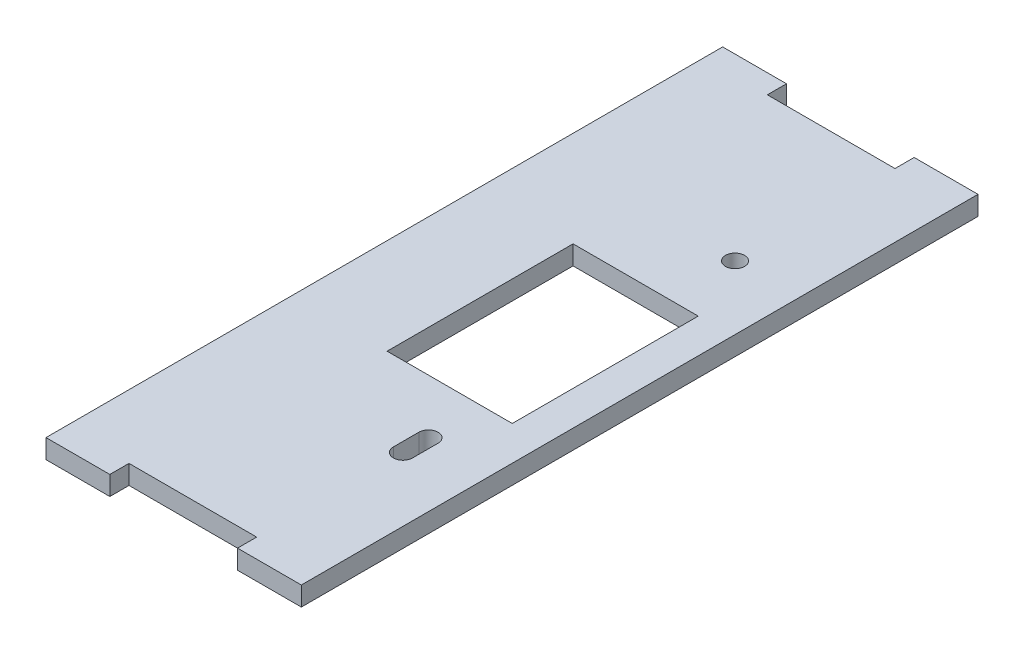
ISO-10303-21;
HEADER;
FILE_DESCRIPTION(('STEP AP214'),'2;1');
FILE_NAME('part.step','',(''),(''),'','','');
FILE_SCHEMA(('AUTOMOTIVE_DESIGN { 1 0 10303 214 1 1 1 1 }'));
ENDSEC;
DATA;
#1=APPLICATION_CONTEXT('core data for automotive mechanical design processes');
#2=APPLICATION_PROTOCOL_DEFINITION('international standard','automotive_design',2000,#1);
#3=PRODUCT_CONTEXT('',#1,'mechanical');
#4=PRODUCT('Part','Part','',(#3));
#5=PRODUCT_RELATED_PRODUCT_CATEGORY('part','',(#4));
#6=PRODUCT_DEFINITION_FORMATION('','',#4);
#7=PRODUCT_DEFINITION_CONTEXT('part definition',#1,'design');
#8=PRODUCT_DEFINITION('design','',#6,#7);
#9=PRODUCT_DEFINITION_SHAPE('','',#8);
#10=(LENGTH_UNIT() NAMED_UNIT(*) SI_UNIT(.MILLI.,.METRE.));
#11=(NAMED_UNIT(*) PLANE_ANGLE_UNIT() SI_UNIT($,.RADIAN.));
#12=(NAMED_UNIT(*) SI_UNIT($,.STERADIAN.) SOLID_ANGLE_UNIT());
#13=UNCERTAINTY_MEASURE_WITH_UNIT(LENGTH_MEASURE(1.E-05),#10,'distance_accuracy_value','');
#14=(GEOMETRIC_REPRESENTATION_CONTEXT(3) GLOBAL_UNCERTAINTY_ASSIGNED_CONTEXT((#13)) GLOBAL_UNIT_ASSIGNED_CONTEXT((#10,
#11,#12)) REPRESENTATION_CONTEXT('',''));
#15=CARTESIAN_POINT('',(0.,0.,0.));
#16=DIRECTION('',(0.,0.,1.));
#17=DIRECTION('',(1.,0.,0.));
#18=AXIS2_PLACEMENT_3D('',#15,#16,#17);
#19=CARTESIAN_POINT('',(0.,3.,-100.));
#20=DIRECTION('',(0.,0.,1.));
#21=DIRECTION('',(1.,0.,0.));
#22=AXIS2_PLACEMENT_3D('',#19,#20,#21);
#23=PLANE('',#22);
#24=DIRECTION('',(-1.,0.,0.));
#25=VECTOR('',#24,1.);
#26=CARTESIAN_POINT('',(0.,3.,-100.));
#27=LINE('',#26,#25);
#28=CARTESIAN_POINT('',(30.,3.,-100.));
#29=VERTEX_POINT('',#28);
#30=CARTESIAN_POINT('',(10.,3.,-100.));
#31=VERTEX_POINT('',#30);
#32=EDGE_CURVE('E12',#29,#31,#27,.T.);
#33=ORIENTED_EDGE('',*,*,#32,.F.);
#34=DIRECTION('',(0.,-1.,0.));
#35=VECTOR('',#34,1.);
#36=CARTESIAN_POINT('',(30.,3.,-100.));
#37=LINE('',#36,#35);
#38=CARTESIAN_POINT('',(30.,0.,-100.));
#39=VERTEX_POINT('',#38);
#40=EDGE_CURVE('E402',#29,#39,#37,.T.);
#41=ORIENTED_EDGE('',*,*,#40,.T.);
#42=DIRECTION('',(-1.,0.,0.));
#43=VECTOR('',#42,1.);
#44=CARTESIAN_POINT('',(0.,0.,-100.));
#45=LINE('',#44,#43);
#46=CARTESIAN_POINT('',(10.,0.,-100.));
#47=VERTEX_POINT('',#46);
#48=EDGE_CURVE('E50',#39,#47,#45,.T.);
#49=ORIENTED_EDGE('',*,*,#48,.T.);
#50=DIRECTION('',(0.,-1.,0.));
#51=VECTOR('',#50,1.);
#52=CARTESIAN_POINT('',(10.,3.,-100.));
#53=LINE('',#52,#51);
#54=EDGE_CURVE('E337',#31,#47,#53,.T.);
#55=ORIENTED_EDGE('',*,*,#54,.F.);
#56=EDGE_LOOP('',(#33,#41,#49,#55));
#57=FACE_BOUND('',#56,.T.);
#58=ADVANCED_FACE('F46',(#57),#23,.F.);
#59=CARTESIAN_POINT('',(0.,3.,0.));
#60=DIRECTION('',(0.,0.,-1.));
#61=DIRECTION('',(-1.,0.,0.));
#62=AXIS2_PLACEMENT_3D('',#59,#60,#61);
#63=PLANE('',#62);
#64=DIRECTION('',(1.,0.,0.));
#65=VECTOR('',#64,1.);
#66=CARTESIAN_POINT('',(0.,0.,0.));
#67=LINE('',#66,#65);
#68=CARTESIAN_POINT('',(10.,0.,0.));
#69=VERTEX_POINT('',#68);
#70=CARTESIAN_POINT('',(30.,0.,0.));
#71=VERTEX_POINT('',#70);
#72=EDGE_CURVE('E302',#69,#71,#67,.T.);
#73=ORIENTED_EDGE('',*,*,#72,.T.);
#74=DIRECTION('',(0.,1.,0.));
#75=VECTOR('',#74,1.);
#76=CARTESIAN_POINT('',(30.,0.,0.));
#77=LINE('',#76,#75);
#78=CARTESIAN_POINT('',(30.,3.,0.));
#79=VERTEX_POINT('',#78);
#80=EDGE_CURVE('E335',#71,#79,#77,.T.);
#81=ORIENTED_EDGE('',*,*,#80,.T.);
#82=DIRECTION('',(1.,0.,0.));
#83=VECTOR('',#82,1.);
#84=CARTESIAN_POINT('',(0.,3.,0.));
#85=LINE('',#84,#83);
#86=CARTESIAN_POINT('',(10.,3.,0.));
#87=VERTEX_POINT('',#86);
#88=EDGE_CURVE('E56',#87,#79,#85,.T.);
#89=ORIENTED_EDGE('',*,*,#88,.F.);
#90=DIRECTION('',(0.,1.,0.));
#91=VECTOR('',#90,1.);
#92=CARTESIAN_POINT('',(10.,0.,0.));
#93=LINE('',#92,#91);
#94=EDGE_CURVE('E303',#69,#87,#93,.T.);
#95=ORIENTED_EDGE('',*,*,#94,.F.);
#96=EDGE_LOOP('',(#73,#81,#89,#95));
#97=FACE_BOUND('',#96,.T.);
#98=ADVANCED_FACE('F427',(#97),#63,.F.);
#99=CARTESIAN_POINT('',(0.,3.,0.));
#100=DIRECTION('',(1.,0.,0.));
#101=DIRECTION('',(0.,0.,-1.));
#102=AXIS2_PLACEMENT_3D('',#99,#100,#101);
#103=PLANE('',#102);
#104=DIRECTION('',(0.,0.,1.));
#105=VECTOR('',#104,1.);
#106=CARTESIAN_POINT('',(0.,0.,0.));
#107=LINE('',#106,#105);
#108=CARTESIAN_POINT('',(0.,0.,-103.));
#109=VERTEX_POINT('',#108);
#110=CARTESIAN_POINT('',(0.,0.,3.));
#111=VERTEX_POINT('',#110);
#112=EDGE_CURVE('E300',#109,#111,#107,.T.);
#113=ORIENTED_EDGE('',*,*,#112,.T.);
#114=DIRECTION('',(0.,1.,0.));
#115=VECTOR('',#114,1.);
#116=CARTESIAN_POINT('',(0.,0.,3.));
#117=LINE('',#116,#115);
#118=CARTESIAN_POINT('',(0.,3.,3.));
#119=VERTEX_POINT('',#118);
#120=EDGE_CURVE('E321',#111,#119,#117,.T.);
#121=ORIENTED_EDGE('',*,*,#120,.T.);
#122=DIRECTION('',(0.,0.,1.));
#123=VECTOR('',#122,1.);
#124=CARTESIAN_POINT('',(0.,3.,0.));
#125=LINE('',#124,#123);
#126=CARTESIAN_POINT('',(0.,3.,-103.));
#127=VERTEX_POINT('',#126);
#128=EDGE_CURVE('E309',#127,#119,#125,.T.);
#129=ORIENTED_EDGE('',*,*,#128,.F.);
#130=DIRECTION('',(0.,-1.,0.));
#131=VECTOR('',#130,1.);
#132=CARTESIAN_POINT('',(0.,3.,-103.));
#133=LINE('',#132,#131);
#134=EDGE_CURVE('E339',#127,#109,#133,.T.);
#135=ORIENTED_EDGE('',*,*,#134,.T.);
#136=EDGE_LOOP('',(#113,#121,#129,#135));
#137=FACE_BOUND('',#136,.T.);
#138=ADVANCED_FACE('F48',(#137),#103,.F.);
#139=CARTESIAN_POINT('',(0.,3.,0.));
#140=DIRECTION('',(0.,-1.,0.));
#141=DIRECTION('',(0.,0.,-1.));
#142=AXIS2_PLACEMENT_3D('',#139,#140,#141);
#143=PLANE('',#142);
#144=DIRECTION('',(-1.,0.,0.));
#145=VECTOR('',#144,1.);
#146=CARTESIAN_POINT('',(0.,3.,-35.4335241021067));
#147=LINE('',#146,#145);
#148=CARTESIAN_POINT('',(34.6087175548564,3.,-35.4335241021067));
#149=VERTEX_POINT('',#148);
#150=CARTESIAN_POINT('',(15.,3.,-35.4335241021067));
#151=VERTEX_POINT('',#150);
#152=EDGE_CURVE('E216',#149,#151,#147,.T.);
#153=ORIENTED_EDGE('',*,*,#152,.T.);
#154=DIRECTION('',(0.,0.,-1.));
#155=VECTOR('',#154,1.);
#156=CARTESIAN_POINT('',(15.,3.,0.));
#157=LINE('',#156,#155);
#158=CARTESIAN_POINT('',(15.,3.,-64.5664758978933));
#159=VERTEX_POINT('',#158);
#160=EDGE_CURVE('E219',#151,#159,#157,.T.);
#161=ORIENTED_EDGE('',*,*,#160,.T.);
#162=DIRECTION('',(1.,0.,0.));
#163=VECTOR('',#162,1.);
#164=CARTESIAN_POINT('',(0.,3.,-64.5664758978933));
#165=LINE('',#164,#163);
#166=CARTESIAN_POINT('',(34.6087175548564,3.,-64.5664758978933));
#167=VERTEX_POINT('',#166);
#168=EDGE_CURVE('E211',#159,#167,#165,.T.);
#169=ORIENTED_EDGE('',*,*,#168,.T.);
#170=DIRECTION('',(0.,0.,1.));
#171=VECTOR('',#170,1.);
#172=CARTESIAN_POINT('',(34.6087175548564,3.,0.));
#173=LINE('',#172,#171);
#174=EDGE_CURVE('E191',#167,#149,#173,.T.);
#175=ORIENTED_EDGE('',*,*,#174,.T.);
#176=EDGE_LOOP('',(#153,#161,#169,#175));
#177=FACE_BOUND('',#176,.T.);
#178=CARTESIAN_POINT('',(30.,3.,-74.9384101052982));
#179=DIRECTION('',(0.,-1.,0.));
#180=DIRECTION('',(0.,0.,-1.));
#181=AXIS2_PLACEMENT_3D('',#178,#179,#180);
#182=CIRCLE('',#181,1.5);
#183=CARTESIAN_POINT('',(30.,3.,-76.4384101052982));
#184=VERTEX_POINT('',#183);
#185=EDGE_CURVE('E254',#184,#184,#182,.T.);
#186=ORIENTED_EDGE('',*,*,#185,.T.);
#187=EDGE_LOOP('',(#186));
#188=FACE_BOUND('',#187,.T.);
#189=DIRECTION('',(0.,0.,1.));
#190=VECTOR('',#189,1.);
#191=CARTESIAN_POINT('',(31.4768203958892,3.,0.));
#192=LINE('',#191,#190);
#193=CARTESIAN_POINT('',(31.4768203958892,3.,-26.9384101052982));
#194=VERTEX_POINT('',#193);
#195=CARTESIAN_POINT('',(31.4768203958892,3.,-22.9384101052982));
#196=VERTEX_POINT('',#195);
#197=EDGE_CURVE('E248',#194,#196,#192,.T.);
#198=ORIENTED_EDGE('',*,*,#197,.T.);
#199=CARTESIAN_POINT('',(29.9768203958892,3.,-22.9384101052982));
#200=DIRECTION('',(0.,-1.,0.));
#201=DIRECTION('',(0.,0.,-1.));
#202=AXIS2_PLACEMENT_3D('',#199,#200,#201);
#203=CIRCLE('',#202,1.5);
#204=CARTESIAN_POINT('',(28.4768203958892,3.,-22.9384101052982));
#205=VERTEX_POINT('',#204);
#206=EDGE_CURVE('E251',#196,#205,#203,.T.);
#207=ORIENTED_EDGE('',*,*,#206,.T.);
#208=DIRECTION('',(0.,0.,-1.));
#209=VECTOR('',#208,1.);
#210=CARTESIAN_POINT('',(28.4768203958892,3.,0.));
#211=LINE('',#210,#209);
#212=CARTESIAN_POINT('',(28.4768203958892,3.,-26.9384101052982));
#213=VERTEX_POINT('',#212);
#214=EDGE_CURVE('E227',#205,#213,#211,.T.);
#215=ORIENTED_EDGE('',*,*,#214,.T.);
#216=CARTESIAN_POINT('',(29.9768203958892,3.,-26.9384101052982));
#217=DIRECTION('',(0.,-1.,0.));
#218=DIRECTION('',(0.,0.,-1.));
#219=AXIS2_PLACEMENT_3D('',#216,#217,#218);
#220=CIRCLE('',#219,1.5);
#221=EDGE_CURVE('E245',#213,#194,#220,.T.);
#222=ORIENTED_EDGE('',*,*,#221,.T.);
#223=EDGE_LOOP('',(#198,#207,#215,#222));
#224=FACE_BOUND('',#223,.T.);
#225=DIRECTION('',(1.,0.,0.));
#226=VECTOR('',#225,1.);
#227=CARTESIAN_POINT('',(30.,3.,3.));
#228=LINE('',#227,#226);
#229=CARTESIAN_POINT('',(30.,3.,3.));
#230=VERTEX_POINT('',#229);
#231=CARTESIAN_POINT('',(40.,3.,3.));
#232=VERTEX_POINT('',#231);
#233=EDGE_CURVE('E284',#230,#232,#228,.T.);
#234=ORIENTED_EDGE('',*,*,#233,.T.);
#235=DIRECTION('',(0.,0.,-1.));
#236=VECTOR('',#235,1.);
#237=CARTESIAN_POINT('',(40.,3.,3.));
#238=LINE('',#237,#236);
#239=CARTESIAN_POINT('',(40.,3.,-103.));
#240=VERTEX_POINT('',#239);
#241=EDGE_CURVE('E258',#232,#240,#238,.T.);
#242=ORIENTED_EDGE('',*,*,#241,.T.);
#243=DIRECTION('',(1.,0.,0.));
#244=VECTOR('',#243,1.);
#245=CARTESIAN_POINT('',(30.,3.,-103.));
#246=LINE('',#245,#244);
#247=CARTESIAN_POINT('',(30.,3.,-103.));
#248=VERTEX_POINT('',#247);
#249=EDGE_CURVE('E362',#248,#240,#246,.T.);
#250=ORIENTED_EDGE('',*,*,#249,.F.);
#251=DIRECTION('',(0.,0.,-1.));
#252=VECTOR('',#251,1.);
#253=CARTESIAN_POINT('',(30.,3.,-100.));
#254=LINE('',#253,#252);
#255=EDGE_CURVE('E365',#29,#248,#254,.T.);
#256=ORIENTED_EDGE('',*,*,#255,.F.);
#257=ORIENTED_EDGE('',*,*,#32,.T.);
#258=DIRECTION('',(0.,0.,1.));
#259=VECTOR('',#258,1.);
#260=CARTESIAN_POINT('',(10.,3.,-100.));
#261=LINE('',#260,#259);
#262=CARTESIAN_POINT('',(10.,3.,-103.));
#263=VERTEX_POINT('',#262);
#264=EDGE_CURVE('E343',#263,#31,#261,.T.);
#265=ORIENTED_EDGE('',*,*,#264,.F.);
#266=DIRECTION('',(1.,0.,0.));
#267=VECTOR('',#266,1.);
#268=CARTESIAN_POINT('',(0.,3.,-103.));
#269=LINE('',#268,#267);
#270=EDGE_CURVE('E349',#127,#263,#269,.T.);
#271=ORIENTED_EDGE('',*,*,#270,.F.);
#272=ORIENTED_EDGE('',*,*,#128,.T.);
#273=DIRECTION('',(1.,0.,0.));
#274=VECTOR('',#273,1.);
#275=CARTESIAN_POINT('',(0.,3.,3.));
#276=LINE('',#275,#274);
#277=CARTESIAN_POINT('',(10.,3.,3.));
#278=VERTEX_POINT('',#277);
#279=EDGE_CURVE('E328',#119,#278,#276,.T.);
#280=ORIENTED_EDGE('',*,*,#279,.T.);
#281=DIRECTION('',(0.,0.,-1.));
#282=VECTOR('',#281,1.);
#283=CARTESIAN_POINT('',(10.,3.,0.));
#284=LINE('',#283,#282);
#285=EDGE_CURVE('E290',#278,#87,#284,.T.);
#286=ORIENTED_EDGE('',*,*,#285,.T.);
#287=ORIENTED_EDGE('',*,*,#88,.T.);
#288=DIRECTION('',(0.,0.,1.));
#289=VECTOR('',#288,1.);
#290=CARTESIAN_POINT('',(30.,3.,0.));
#291=LINE('',#290,#289);
#292=EDGE_CURVE('E279',#79,#230,#291,.T.);
#293=ORIENTED_EDGE('',*,*,#292,.T.);
#294=EDGE_LOOP('',(#234,#242,#250,#256,#257,#265,#271,#272,#280,#286,#287,#293));
#295=FACE_BOUND('',#294,.T.);
#296=ADVANCED_FACE('F375',(#177,#188,#224,#295),#143,.F.);
#297=CARTESIAN_POINT('',(0.,0.,0.));
#298=DIRECTION('',(0.,-1.,0.));
#299=DIRECTION('',(0.,0.,-1.));
#300=AXIS2_PLACEMENT_3D('',#297,#298,#299);
#301=PLANE('',#300);
#302=DIRECTION('',(0.,0.,-1.));
#303=VECTOR('',#302,1.);
#304=CARTESIAN_POINT('',(15.,0.,-64.5664758978933));
#305=LINE('',#304,#303);
#306=CARTESIAN_POINT('',(15.,0.,-35.4335241021067));
#307=VERTEX_POINT('',#306);
#308=CARTESIAN_POINT('',(15.,0.,-64.5664758978933));
#309=VERTEX_POINT('',#308);
#310=EDGE_CURVE('E72',#307,#309,#305,.T.);
#311=ORIENTED_EDGE('',*,*,#310,.F.);
#312=DIRECTION('',(-1.,0.,0.));
#313=VECTOR('',#312,1.);
#314=CARTESIAN_POINT('',(34.6087175548564,0.,-35.4335241021067));
#315=LINE('',#314,#313);
#316=CARTESIAN_POINT('',(34.6087175548564,0.,-35.4335241021067));
#317=VERTEX_POINT('',#316);
#318=EDGE_CURVE('E204',#317,#307,#315,.T.);
#319=ORIENTED_EDGE('',*,*,#318,.F.);
#320=DIRECTION('',(0.,0.,1.));
#321=VECTOR('',#320,1.);
#322=CARTESIAN_POINT('',(34.6087175548564,0.,-64.5664758978933));
#323=LINE('',#322,#321);
#324=CARTESIAN_POINT('',(34.6087175548564,0.,-64.5664758978933));
#325=VERTEX_POINT('',#324);
#326=EDGE_CURVE('E188',#325,#317,#323,.T.);
#327=ORIENTED_EDGE('',*,*,#326,.F.);
#328=DIRECTION('',(1.,0.,0.));
#329=VECTOR('',#328,1.);
#330=CARTESIAN_POINT('',(34.6087175548564,0.,-64.5664758978933));
#331=LINE('',#330,#329);
#332=EDGE_CURVE('E197',#309,#325,#331,.T.);
#333=ORIENTED_EDGE('',*,*,#332,.F.);
#334=EDGE_LOOP('',(#311,#319,#327,#333));
#335=FACE_BOUND('',#334,.T.);
#336=CARTESIAN_POINT('',(30.,0.,-74.9384101052982));
#337=DIRECTION('',(0.,-1.,0.));
#338=DIRECTION('',(0.,0.,-1.));
#339=AXIS2_PLACEMENT_3D('',#336,#337,#338);
#340=CIRCLE('',#339,1.5);
#341=CARTESIAN_POINT('',(30.,0.,-76.4384101052982));
#342=VERTEX_POINT('',#341);
#343=EDGE_CURVE('E223',#342,#342,#340,.T.);
#344=ORIENTED_EDGE('',*,*,#343,.F.);
#345=EDGE_LOOP('',(#344));
#346=FACE_BOUND('',#345,.T.);
#347=CARTESIAN_POINT('',(29.9768203958892,0.,-22.9384101052982));
#348=DIRECTION('',(0.,-1.,0.));
#349=DIRECTION('',(0.,0.,-1.));
#350=AXIS2_PLACEMENT_3D('',#347,#348,#349);
#351=CIRCLE('',#350,1.5);
#352=CARTESIAN_POINT('',(31.4768203958892,0.,-22.9384101052982));
#353=VERTEX_POINT('',#352);
#354=CARTESIAN_POINT('',(28.4768203958892,0.,-22.9384101052982));
#355=VERTEX_POINT('',#354);
#356=EDGE_CURVE('E228',#353,#355,#351,.T.);
#357=ORIENTED_EDGE('',*,*,#356,.F.);
#358=DIRECTION('',(0.,0.,1.));
#359=VECTOR('',#358,1.);
#360=CARTESIAN_POINT('',(31.4768203958892,0.,-26.9384101052982));
#361=LINE('',#360,#359);
#362=CARTESIAN_POINT('',(31.4768203958892,0.,-26.9384101052982));
#363=VERTEX_POINT('',#362);
#364=EDGE_CURVE('E629',#363,#353,#361,.T.);
#365=ORIENTED_EDGE('',*,*,#364,.F.);
#366=CARTESIAN_POINT('',(29.9768203958892,0.,-26.9384101052982));
#367=DIRECTION('',(0.,-1.,0.));
#368=DIRECTION('',(0.,0.,-1.));
#369=AXIS2_PLACEMENT_3D('',#366,#367,#368);
#370=CIRCLE('',#369,1.5);
#371=CARTESIAN_POINT('',(28.4768203958892,0.,-26.9384101052982));
#372=VERTEX_POINT('',#371);
#373=EDGE_CURVE('E634',#372,#363,#370,.T.);
#374=ORIENTED_EDGE('',*,*,#373,.F.);
#375=DIRECTION('',(0.,0.,-1.));
#376=VECTOR('',#375,1.);
#377=CARTESIAN_POINT('',(28.4768203958892,0.,-26.9384101052982));
#378=LINE('',#377,#376);
#379=EDGE_CURVE('E240',#355,#372,#378,.T.);
#380=ORIENTED_EDGE('',*,*,#379,.F.);
#381=EDGE_LOOP('',(#357,#365,#374,#380));
#382=FACE_BOUND('',#381,.T.);
#383=DIRECTION('',(0.,0.,-1.));
#384=VECTOR('',#383,1.);
#385=CARTESIAN_POINT('',(40.,0.,3.));
#386=LINE('',#385,#384);
#387=CARTESIAN_POINT('',(40.,0.,3.));
#388=VERTEX_POINT('',#387);
#389=CARTESIAN_POINT('',(40.,0.,-103.));
#390=VERTEX_POINT('',#389);
#391=EDGE_CURVE('E257',#388,#390,#386,.T.);
#392=ORIENTED_EDGE('',*,*,#391,.F.);
#393=DIRECTION('',(1.,0.,0.));
#394=VECTOR('',#393,1.);
#395=CARTESIAN_POINT('',(30.,0.,3.));
#396=LINE('',#395,#394);
#397=CARTESIAN_POINT('',(30.,0.,3.));
#398=VERTEX_POINT('',#397);
#399=EDGE_CURVE('E273',#398,#388,#396,.T.);
#400=ORIENTED_EDGE('',*,*,#399,.F.);
#401=DIRECTION('',(0.,0.,1.));
#402=VECTOR('',#401,1.);
#403=CARTESIAN_POINT('',(30.,0.,0.));
#404=LINE('',#403,#402);
#405=EDGE_CURVE('E277',#71,#398,#404,.T.);
#406=ORIENTED_EDGE('',*,*,#405,.F.);
#407=ORIENTED_EDGE('',*,*,#72,.F.);
#408=DIRECTION('',(0.,0.,-1.));
#409=VECTOR('',#408,1.);
#410=CARTESIAN_POINT('',(10.,0.,0.));
#411=LINE('',#410,#409);
#412=CARTESIAN_POINT('',(10.,0.,3.));
#413=VERTEX_POINT('',#412);
#414=EDGE_CURVE('E289',#413,#69,#411,.T.);
#415=ORIENTED_EDGE('',*,*,#414,.F.);
#416=DIRECTION('',(1.,0.,0.));
#417=VECTOR('',#416,1.);
#418=CARTESIAN_POINT('',(0.,0.,3.));
#419=LINE('',#418,#417);
#420=EDGE_CURVE('E285',#111,#413,#419,.T.);
#421=ORIENTED_EDGE('',*,*,#420,.F.);
#422=ORIENTED_EDGE('',*,*,#112,.F.);
#423=DIRECTION('',(1.,0.,0.));
#424=VECTOR('',#423,1.);
#425=CARTESIAN_POINT('',(0.,0.,-103.));
#426=LINE('',#425,#424);
#427=CARTESIAN_POINT('',(10.,0.,-103.));
#428=VERTEX_POINT('',#427);
#429=EDGE_CURVE('E350',#109,#428,#426,.T.);
#430=ORIENTED_EDGE('',*,*,#429,.T.);
#431=DIRECTION('',(0.,0.,1.));
#432=VECTOR('',#431,1.);
#433=CARTESIAN_POINT('',(10.,0.,-100.));
#434=LINE('',#433,#432);
#435=EDGE_CURVE('E346',#428,#47,#434,.T.);
#436=ORIENTED_EDGE('',*,*,#435,.T.);
#437=ORIENTED_EDGE('',*,*,#48,.F.);
#438=DIRECTION('',(0.,0.,-1.));
#439=VECTOR('',#438,1.);
#440=CARTESIAN_POINT('',(30.,0.,-100.));
#441=LINE('',#440,#439);
#442=CARTESIAN_POINT('',(30.,0.,-103.));
#443=VERTEX_POINT('',#442);
#444=EDGE_CURVE('E355',#39,#443,#441,.T.);
#445=ORIENTED_EDGE('',*,*,#444,.T.);
#446=DIRECTION('',(1.,0.,0.));
#447=VECTOR('',#446,1.);
#448=CARTESIAN_POINT('',(30.,0.,-103.));
#449=LINE('',#448,#447);
#450=EDGE_CURVE('E359',#443,#390,#449,.T.);
#451=ORIENTED_EDGE('',*,*,#450,.T.);
#452=EDGE_LOOP('',(#392,#400,#406,#407,#415,#421,#422,#430,#436,#437,#445,#451));
#453=FACE_BOUND('',#452,.T.);
#454=ADVANCED_FACE('F201',(#335,#346,#382,#453),#301,.T.);
#455=CARTESIAN_POINT('',(10.,0.,0.));
#456=DIRECTION('',(1.,0.,0.));
#457=DIRECTION('',(0.,0.,-1.));
#458=AXIS2_PLACEMENT_3D('',#455,#456,#457);
#459=PLANE('',#458);
#460=ORIENTED_EDGE('',*,*,#285,.F.);
#461=DIRECTION('',(0.,1.,0.));
#462=VECTOR('',#461,1.);
#463=CARTESIAN_POINT('',(10.,0.,3.));
#464=LINE('',#463,#462);
#465=EDGE_CURVE('E323',#413,#278,#464,.T.);
#466=ORIENTED_EDGE('',*,*,#465,.F.);
#467=ORIENTED_EDGE('',*,*,#414,.T.);
#468=ORIENTED_EDGE('',*,*,#94,.T.);
#469=EDGE_LOOP('',(#460,#466,#467,#468));
#470=FACE_BOUND('',#469,.T.);
#471=ADVANCED_FACE('F391',(#470),#459,.T.);
#472=CARTESIAN_POINT('',(0.,0.,3.));
#473=DIRECTION('',(0.,0.,1.));
#474=DIRECTION('',(1.,0.,0.));
#475=AXIS2_PLACEMENT_3D('',#472,#473,#474);
#476=PLANE('',#475);
#477=ORIENTED_EDGE('',*,*,#279,.F.);
#478=ORIENTED_EDGE('',*,*,#120,.F.);
#479=ORIENTED_EDGE('',*,*,#420,.T.);
#480=ORIENTED_EDGE('',*,*,#465,.T.);
#481=EDGE_LOOP('',(#477,#478,#479,#480));
#482=FACE_BOUND('',#481,.T.);
#483=ADVANCED_FACE('F386',(#482),#476,.T.);
#484=CARTESIAN_POINT('',(30.,0.,0.));
#485=DIRECTION('',(-1.,0.,0.));
#486=DIRECTION('',(0.,0.,1.));
#487=AXIS2_PLACEMENT_3D('',#484,#485,#486);
#488=PLANE('',#487);
#489=ORIENTED_EDGE('',*,*,#292,.F.);
#490=ORIENTED_EDGE('',*,*,#80,.F.);
#491=ORIENTED_EDGE('',*,*,#405,.T.);
#492=DIRECTION('',(0.,1.,0.));
#493=VECTOR('',#492,1.);
#494=CARTESIAN_POINT('',(30.,0.,3.));
#495=LINE('',#494,#493);
#496=EDGE_CURVE('E278',#398,#230,#495,.T.);
#497=ORIENTED_EDGE('',*,*,#496,.T.);
#498=EDGE_LOOP('',(#489,#490,#491,#497));
#499=FACE_BOUND('',#498,.T.);
#500=ADVANCED_FACE('F393',(#499),#488,.T.);
#501=CARTESIAN_POINT('',(30.,0.,3.));
#502=DIRECTION('',(0.,0.,1.));
#503=DIRECTION('',(1.,0.,0.));
#504=AXIS2_PLACEMENT_3D('',#501,#502,#503);
#505=PLANE('',#504);
#506=DIRECTION('',(0.,-1.,0.));
#507=VECTOR('',#506,1.);
#508=CARTESIAN_POINT('',(40.,3.,3.));
#509=LINE('',#508,#507);
#510=EDGE_CURVE('E261',#232,#388,#509,.T.);
#511=ORIENTED_EDGE('',*,*,#510,.F.);
#512=ORIENTED_EDGE('',*,*,#233,.F.);
#513=ORIENTED_EDGE('',*,*,#496,.F.);
#514=ORIENTED_EDGE('',*,*,#399,.T.);
#515=EDGE_LOOP('',(#511,#512,#513,#514));
#516=FACE_BOUND('',#515,.T.);
#517=ADVANCED_FACE('F398',(#516),#505,.T.);
#518=CARTESIAN_POINT('',(10.,3.,-100.));
#519=DIRECTION('',(1.,0.,0.));
#520=DIRECTION('',(0.,0.,-1.));
#521=AXIS2_PLACEMENT_3D('',#518,#519,#520);
#522=PLANE('',#521);
#523=ORIENTED_EDGE('',*,*,#435,.F.);
#524=DIRECTION('',(0.,-1.,0.));
#525=VECTOR('',#524,1.);
#526=CARTESIAN_POINT('',(10.,3.,-103.));
#527=LINE('',#526,#525);
#528=EDGE_CURVE('E342',#263,#428,#527,.T.);
#529=ORIENTED_EDGE('',*,*,#528,.F.);
#530=ORIENTED_EDGE('',*,*,#264,.T.);
#531=ORIENTED_EDGE('',*,*,#54,.T.);
#532=EDGE_LOOP('',(#523,#529,#530,#531));
#533=FACE_BOUND('',#532,.T.);
#534=ADVANCED_FACE('F374',(#533),#522,.T.);
#535=CARTESIAN_POINT('',(0.,3.,-103.));
#536=DIRECTION('',(0.,0.,-1.));
#537=DIRECTION('',(-1.,0.,0.));
#538=AXIS2_PLACEMENT_3D('',#535,#536,#537);
#539=PLANE('',#538);
#540=ORIENTED_EDGE('',*,*,#429,.F.);
#541=ORIENTED_EDGE('',*,*,#134,.F.);
#542=ORIENTED_EDGE('',*,*,#270,.T.);
#543=ORIENTED_EDGE('',*,*,#528,.T.);
#544=EDGE_LOOP('',(#540,#541,#542,#543));
#545=FACE_BOUND('',#544,.T.);
#546=ADVANCED_FACE('F380',(#545),#539,.T.);
#547=CARTESIAN_POINT('',(30.,3.,-100.));
#548=DIRECTION('',(-1.,0.,0.));
#549=DIRECTION('',(0.,0.,1.));
#550=AXIS2_PLACEMENT_3D('',#547,#548,#549);
#551=PLANE('',#550);
#552=ORIENTED_EDGE('',*,*,#444,.F.);
#553=ORIENTED_EDGE('',*,*,#40,.F.);
#554=ORIENTED_EDGE('',*,*,#255,.T.);
#555=DIRECTION('',(0.,-1.,0.));
#556=VECTOR('',#555,1.);
#557=CARTESIAN_POINT('',(30.,3.,-103.));
#558=LINE('',#557,#556);
#559=EDGE_CURVE('E366',#248,#443,#558,.T.);
#560=ORIENTED_EDGE('',*,*,#559,.T.);
#561=EDGE_LOOP('',(#552,#553,#554,#560));
#562=FACE_BOUND('',#561,.T.);
#563=ADVANCED_FACE('F407',(#562),#551,.T.);
#564=CARTESIAN_POINT('',(30.,3.,-103.));
#565=DIRECTION('',(0.,0.,-1.));
#566=DIRECTION('',(-1.,0.,0.));
#567=AXIS2_PLACEMENT_3D('',#564,#565,#566);
#568=PLANE('',#567);
#569=DIRECTION('',(0.,-1.,0.));
#570=VECTOR('',#569,1.);
#571=CARTESIAN_POINT('',(40.,3.,-103.));
#572=LINE('',#571,#570);
#573=EDGE_CURVE('E264',#240,#390,#572,.T.);
#574=ORIENTED_EDGE('',*,*,#573,.T.);
#575=ORIENTED_EDGE('',*,*,#450,.F.);
#576=ORIENTED_EDGE('',*,*,#559,.F.);
#577=ORIENTED_EDGE('',*,*,#249,.T.);
#578=EDGE_LOOP('',(#574,#575,#576,#577));
#579=FACE_BOUND('',#578,.T.);
#580=ADVANCED_FACE('F413',(#579),#568,.T.);
#581=CARTESIAN_POINT('',(40.,3.,3.));
#582=DIRECTION('',(-1.,0.,0.));
#583=DIRECTION('',(0.,0.,1.));
#584=AXIS2_PLACEMENT_3D('',#581,#582,#583);
#585=PLANE('',#584);
#586=ORIENTED_EDGE('',*,*,#391,.T.);
#587=ORIENTED_EDGE('',*,*,#573,.F.);
#588=ORIENTED_EDGE('',*,*,#241,.F.);
#589=ORIENTED_EDGE('',*,*,#510,.T.);
#590=EDGE_LOOP('',(#586,#587,#588,#589));
#591=FACE_BOUND('',#590,.T.);
#592=ADVANCED_FACE('F411',(#591),#585,.F.);
#593=CARTESIAN_POINT('',(29.9768203958892,10.,-22.9384101052982));
#594=DIRECTION('',(0.,-1.,0.));
#595=DIRECTION('',(0.,0.,-1.));
#596=AXIS2_PLACEMENT_3D('',#593,#594,#595);
#597=CYLINDRICAL_SURFACE('',#596,1.5);
#598=DIRECTION('',(0.,-1.,0.));
#599=VECTOR('',#598,1.);
#600=CARTESIAN_POINT('',(31.4768203958892,10.,-22.9384101052982));
#601=LINE('',#600,#599);
#602=EDGE_CURVE('E222',#196,#353,#601,.T.);
#603=ORIENTED_EDGE('',*,*,#602,.T.);
#604=ORIENTED_EDGE('',*,*,#356,.T.);
#605=DIRECTION('',(0.,-1.,0.));
#606=VECTOR('',#605,1.);
#607=CARTESIAN_POINT('',(28.4768203958892,10.,-22.9384101052982));
#608=LINE('',#607,#606);
#609=EDGE_CURVE('E229',#205,#355,#608,.T.);
#610=ORIENTED_EDGE('',*,*,#609,.F.);
#611=ORIENTED_EDGE('',*,*,#206,.F.);
#612=EDGE_LOOP('',(#603,#604,#610,#611));
#613=FACE_BOUND('',#612,.T.);
#614=ADVANCED_FACE('F421',(#613),#597,.F.);
#615=CARTESIAN_POINT('',(31.4768203958892,10.,-26.9384101052982));
#616=DIRECTION('',(1.,0.,0.));
#617=DIRECTION('',(0.,0.,-1.));
#618=AXIS2_PLACEMENT_3D('',#615,#616,#617);
#619=PLANE('',#618);
#620=DIRECTION('',(0.,-1.,0.));
#621=VECTOR('',#620,1.);
#622=CARTESIAN_POINT('',(31.4768203958892,10.,-26.9384101052982));
#623=LINE('',#622,#621);
#624=EDGE_CURVE('E626',#194,#363,#623,.T.);
#625=ORIENTED_EDGE('',*,*,#624,.T.);
#626=ORIENTED_EDGE('',*,*,#364,.T.);
#627=ORIENTED_EDGE('',*,*,#602,.F.);
#628=ORIENTED_EDGE('',*,*,#197,.F.);
#629=EDGE_LOOP('',(#625,#626,#627,#628));
#630=FACE_BOUND('',#629,.T.);
#631=ADVANCED_FACE('F583',(#630),#619,.F.);
#632=CARTESIAN_POINT('',(29.9768203958892,10.,-26.9384101052982));
#633=DIRECTION('',(0.,-1.,0.));
#634=DIRECTION('',(0.,0.,-1.));
#635=AXIS2_PLACEMENT_3D('',#632,#633,#634);
#636=CYLINDRICAL_SURFACE('',#635,1.5);
#637=DIRECTION('',(0.,-1.,0.));
#638=VECTOR('',#637,1.);
#639=CARTESIAN_POINT('',(28.4768203958892,10.,-26.9384101052982));
#640=LINE('',#639,#638);
#641=EDGE_CURVE('E640',#213,#372,#640,.T.);
#642=ORIENTED_EDGE('',*,*,#641,.T.);
#643=ORIENTED_EDGE('',*,*,#373,.T.);
#644=ORIENTED_EDGE('',*,*,#624,.F.);
#645=ORIENTED_EDGE('',*,*,#221,.F.);
#646=EDGE_LOOP('',(#642,#643,#644,#645));
#647=FACE_BOUND('',#646,.T.);
#648=ADVANCED_FACE('F574',(#647),#636,.F.);
#649=CARTESIAN_POINT('',(28.4768203958892,10.,-26.9384101052982));
#650=DIRECTION('',(-1.,0.,0.));
#651=DIRECTION('',(0.,0.,1.));
#652=AXIS2_PLACEMENT_3D('',#649,#650,#651);
#653=PLANE('',#652);
#654=ORIENTED_EDGE('',*,*,#609,.T.);
#655=ORIENTED_EDGE('',*,*,#379,.T.);
#656=ORIENTED_EDGE('',*,*,#641,.F.);
#657=ORIENTED_EDGE('',*,*,#214,.F.);
#658=EDGE_LOOP('',(#654,#655,#656,#657));
#659=FACE_BOUND('',#658,.T.);
#660=ADVANCED_FACE('F565',(#659),#653,.F.);
#661=CARTESIAN_POINT('',(30.,10.,-74.9384101052982));
#662=DIRECTION('',(0.,-1.,0.));
#663=DIRECTION('',(0.,0.,-1.));
#664=AXIS2_PLACEMENT_3D('',#661,#662,#663);
#665=CYLINDRICAL_SURFACE('',#664,1.5);
#666=ORIENTED_EDGE('',*,*,#343,.T.);
#667=EDGE_LOOP('',(#666));
#668=FACE_BOUND('',#667,.T.);
#669=ORIENTED_EDGE('',*,*,#185,.F.);
#670=EDGE_LOOP('',(#669));
#671=FACE_BOUND('',#670,.T.);
#672=ADVANCED_FACE('F531',(#668,#671),#665,.F.);
#673=CARTESIAN_POINT('',(15.,10.,-64.5664758978933));
#674=DIRECTION('',(-1.,0.,0.));
#675=DIRECTION('',(0.,0.,1.));
#676=AXIS2_PLACEMENT_3D('',#673,#674,#675);
#677=PLANE('',#676);
#678=DIRECTION('',(0.,-1.,0.));
#679=VECTOR('',#678,1.);
#680=CARTESIAN_POINT('',(15.,10.,-35.4335241021067));
#681=LINE('',#680,#679);
#682=EDGE_CURVE('E209',#151,#307,#681,.T.);
#683=ORIENTED_EDGE('',*,*,#682,.T.);
#684=ORIENTED_EDGE('',*,*,#310,.T.);
#685=DIRECTION('',(0.,-1.,0.));
#686=VECTOR('',#685,1.);
#687=CARTESIAN_POINT('',(15.,10.,-64.5664758978933));
#688=LINE('',#687,#686);
#689=EDGE_CURVE('E194',#159,#309,#688,.T.);
#690=ORIENTED_EDGE('',*,*,#689,.F.);
#691=ORIENTED_EDGE('',*,*,#160,.F.);
#692=EDGE_LOOP('',(#683,#684,#690,#691));
#693=FACE_BOUND('',#692,.T.);
#694=ADVANCED_FACE('F526',(#693),#677,.F.);
#695=CARTESIAN_POINT('',(34.6087175548564,10.,-35.4335241021067));
#696=DIRECTION('',(0.,0.,1.));
#697=DIRECTION('',(1.,0.,0.));
#698=AXIS2_PLACEMENT_3D('',#695,#696,#697);
#699=PLANE('',#698);
#700=DIRECTION('',(0.,-1.,0.));
#701=VECTOR('',#700,1.);
#702=CARTESIAN_POINT('',(34.6087175548564,10.,-35.4335241021067));
#703=LINE('',#702,#701);
#704=EDGE_CURVE('E193',#149,#317,#703,.T.);
#705=ORIENTED_EDGE('',*,*,#704,.T.);
#706=ORIENTED_EDGE('',*,*,#318,.T.);
#707=ORIENTED_EDGE('',*,*,#682,.F.);
#708=ORIENTED_EDGE('',*,*,#152,.F.);
#709=EDGE_LOOP('',(#705,#706,#707,#708));
#710=FACE_BOUND('',#709,.T.);
#711=ADVANCED_FACE('F530',(#710),#699,.F.);
#712=CARTESIAN_POINT('',(34.6087175548564,10.,-64.5664758978933));
#713=DIRECTION('',(1.,0.,0.));
#714=DIRECTION('',(0.,0.,-1.));
#715=AXIS2_PLACEMENT_3D('',#712,#713,#714);
#716=PLANE('',#715);
#717=DIRECTION('',(0.,-1.,0.));
#718=VECTOR('',#717,1.);
#719=CARTESIAN_POINT('',(34.6087175548564,10.,-64.5664758978933));
#720=LINE('',#719,#718);
#721=EDGE_CURVE('E64',#167,#325,#720,.T.);
#722=ORIENTED_EDGE('',*,*,#721,.T.);
#723=ORIENTED_EDGE('',*,*,#326,.T.);
#724=ORIENTED_EDGE('',*,*,#704,.F.);
#725=ORIENTED_EDGE('',*,*,#174,.F.);
#726=EDGE_LOOP('',(#722,#723,#724,#725));
#727=FACE_BOUND('',#726,.T.);
#728=ADVANCED_FACE('F185',(#727),#716,.F.);
#729=CARTESIAN_POINT('',(34.6087175548564,10.,-64.5664758978933));
#730=DIRECTION('',(0.,0.,-1.));
#731=DIRECTION('',(-1.,0.,0.));
#732=AXIS2_PLACEMENT_3D('',#729,#730,#731);
#733=PLANE('',#732);
#734=ORIENTED_EDGE('',*,*,#689,.T.);
#735=ORIENTED_EDGE('',*,*,#332,.T.);
#736=ORIENTED_EDGE('',*,*,#721,.F.);
#737=ORIENTED_EDGE('',*,*,#168,.F.);
#738=EDGE_LOOP('',(#734,#735,#736,#737));
#739=FACE_BOUND('',#738,.T.);
#740=ADVANCED_FACE('F198',(#739),#733,.F.);
#741=CLOSED_SHELL('',(#58,#98,#138,#296,#454,#471,#483,#500,#517,#534,#546,#563,#580,#592,#614,
#631,#648,#660,#672,#694,#711,#728,#740));
#742=MANIFOLD_SOLID_BREP('B2',#741);
#743=ADVANCED_BREP_SHAPE_REPRESENTATION('',(#18,#742),#14);
#744=SHAPE_DEFINITION_REPRESENTATION(#9,#743);
ENDSEC;
END-ISO-10303-21;
